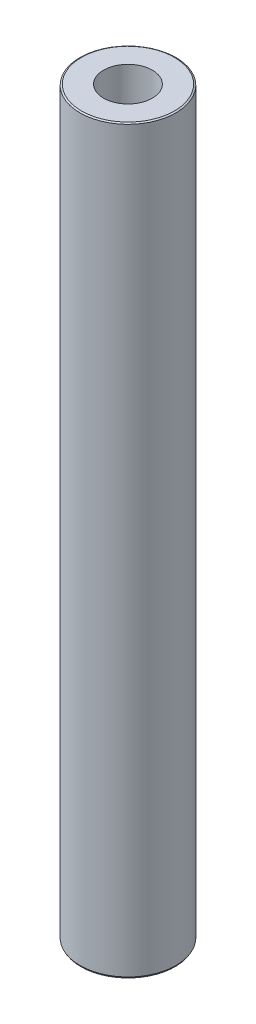
ISO-10303-21;
HEADER;
FILE_DESCRIPTION(('STEP AP214'),'2;1');
FILE_NAME('part.step','',(''),(''),'','','');
FILE_SCHEMA(('AUTOMOTIVE_DESIGN { 1 0 10303 214 1 1 1 1 }'));
ENDSEC;
DATA;
#1=APPLICATION_CONTEXT('core data for automotive mechanical design processes');
#2=APPLICATION_PROTOCOL_DEFINITION('international standard','automotive_design',2000,#1);
#3=PRODUCT_CONTEXT('',#1,'mechanical');
#4=PRODUCT('Part','Part','',(#3));
#5=PRODUCT_RELATED_PRODUCT_CATEGORY('part','',(#4));
#6=PRODUCT_DEFINITION_FORMATION('','',#4);
#7=PRODUCT_DEFINITION_CONTEXT('part definition',#1,'design');
#8=PRODUCT_DEFINITION('design','',#6,#7);
#9=PRODUCT_DEFINITION_SHAPE('','',#8);
#10=(LENGTH_UNIT() NAMED_UNIT(*) SI_UNIT(.MILLI.,.METRE.));
#11=(NAMED_UNIT(*) PLANE_ANGLE_UNIT() SI_UNIT($,.RADIAN.));
#12=(NAMED_UNIT(*) SI_UNIT($,.STERADIAN.) SOLID_ANGLE_UNIT());
#13=UNCERTAINTY_MEASURE_WITH_UNIT(LENGTH_MEASURE(1.E-05),#10,'distance_accuracy_value','');
#14=(GEOMETRIC_REPRESENTATION_CONTEXT(3) GLOBAL_UNCERTAINTY_ASSIGNED_CONTEXT((#13)) GLOBAL_UNIT_ASSIGNED_CONTEXT((#10,
#11,#12)) REPRESENTATION_CONTEXT('',''));
#15=CARTESIAN_POINT('',(0.,0.,0.));
#16=DIRECTION('',(0.,0.,1.));
#17=DIRECTION('',(1.,0.,0.));
#18=AXIS2_PLACEMENT_3D('',#15,#16,#17);
#19=CARTESIAN_POINT('',(0.,540.408234827702,0.));
#20=DIRECTION('',(0.,-1.,0.));
#21=DIRECTION('',(0.,0.,-1.));
#22=AXIS2_PLACEMENT_3D('',#19,#20,#21);
#23=CYLINDRICAL_SURFACE('',#22,35.);
#24=CARTESIAN_POINT('',(0.,539.767455256213,0.));
#25=DIRECTION('',(0.,1.,0.));
#26=DIRECTION('',(0.,0.,1.));
#27=AXIS2_PLACEMENT_3D('',#24,#25,#26);
#28=CIRCLE('',#27,35.);
#29=CARTESIAN_POINT('',(0.,539.767455256213,35.));
#30=VERTEX_POINT('',#29);
#31=EDGE_CURVE('E50',#30,#30,#28,.F.);
#32=ORIENTED_EDGE('',*,*,#31,.T.);
#33=EDGE_LOOP('',(#32));
#34=FACE_BOUND('',#33,.T.);
#35=CARTESIAN_POINT('',(0.,1.10986277427283,0.));
#36=DIRECTION('',(0.,1.,0.));
#37=DIRECTION('',(0.,0.,1.));
#38=AXIS2_PLACEMENT_3D('',#35,#36,#37);
#39=CIRCLE('',#38,35.);
#40=CARTESIAN_POINT('',(0.,1.10986277427283,35.));
#41=VERTEX_POINT('',#40);
#42=EDGE_CURVE('E51',#41,#41,#39,.T.);
#43=ORIENTED_EDGE('',*,*,#42,.T.);
#44=EDGE_LOOP('',(#43));
#45=FACE_BOUND('',#44,.T.);
#46=ADVANCED_FACE('F39',(#34,#45),#23,.T.);
#47=CARTESIAN_POINT('',(0.,540.408234827702,0.));
#48=DIRECTION('',(0.,1.,0.));
#49=DIRECTION('',(0.,0.,1.));
#50=AXIS2_PLACEMENT_3D('',#47,#48,#49);
#51=PLANE('',#50);
#52=CARTESIAN_POINT('',(0.,540.408234827702,0.));
#53=DIRECTION('',(0.,1.,0.));
#54=DIRECTION('',(0.,0.,1.));
#55=AXIS2_PLACEMENT_3D('',#52,#53,#54);
#56=CIRCLE('',#55,33.8901372257275);
#57=CARTESIAN_POINT('',(0.,540.408234827702,33.8901372257275));
#58=VERTEX_POINT('',#57);
#59=EDGE_CURVE('E54',#58,#58,#56,.T.);
#60=ORIENTED_EDGE('',*,*,#59,.T.);
#61=EDGE_LOOP('',(#60));
#62=FACE_BOUND('',#61,.T.);
#63=CARTESIAN_POINT('',(0.,540.408234827702,0.));
#64=DIRECTION('',(0.,1.,0.));
#65=DIRECTION('',(0.,0.,1.));
#66=AXIS2_PLACEMENT_3D('',#63,#64,#65);
#67=CIRCLE('',#66,17.7537579420292);
#68=CARTESIAN_POINT('',(0.,540.408234827702,17.7537579420292));
#69=VERTEX_POINT('',#68);
#70=EDGE_CURVE('E58',#69,#69,#67,.T.);
#71=ORIENTED_EDGE('',*,*,#70,.F.);
#72=EDGE_LOOP('',(#71));
#73=FACE_BOUND('',#72,.T.);
#74=ADVANCED_FACE('F69',(#62,#73),#51,.T.);
#75=CARTESIAN_POINT('',(0.,0.,0.));
#76=DIRECTION('',(0.,1.,0.));
#77=DIRECTION('',(0.,0.,1.));
#78=AXIS2_PLACEMENT_3D('',#75,#76,#77);
#79=PLANE('',#78);
#80=CARTESIAN_POINT('',(0.,0.,0.));
#81=DIRECTION('',(0.,1.,0.));
#82=DIRECTION('',(0.,0.,1.));
#83=AXIS2_PLACEMENT_3D('',#80,#81,#82);
#84=CIRCLE('',#83,34.35922042851);
#85=CARTESIAN_POINT('',(0.,0.,34.35922042851));
#86=VERTEX_POINT('',#85);
#87=EDGE_CURVE('E10',#86,#86,#84,.F.);
#88=ORIENTED_EDGE('',*,*,#87,.T.);
#89=EDGE_LOOP('',(#88));
#90=FACE_BOUND('',#89,.T.);
#91=CARTESIAN_POINT('',(0.,0.,0.));
#92=DIRECTION('',(0.,1.,0.));
#93=DIRECTION('',(0.,0.,1.));
#94=AXIS2_PLACEMENT_3D('',#91,#92,#93);
#95=CIRCLE('',#94,17.7537579420292);
#96=CARTESIAN_POINT('',(0.,0.,17.7537579420292));
#97=VERTEX_POINT('',#96);
#98=EDGE_CURVE('E63',#97,#97,#95,.T.);
#99=ORIENTED_EDGE('',*,*,#98,.T.);
#100=EDGE_LOOP('',(#99));
#101=FACE_BOUND('',#100,.T.);
#102=ADVANCED_FACE('F75',(#90,#101),#79,.F.);
#103=CARTESIAN_POINT('',(0.,540.408234827702,0.));
#104=DIRECTION('',(0.,-1.,0.));
#105=DIRECTION('',(0.,0.,-1.));
#106=AXIS2_PLACEMENT_3D('',#103,#104,#105);
#107=CYLINDRICAL_SURFACE('',#106,17.7537579420292);
#108=ORIENTED_EDGE('',*,*,#70,.T.);
#109=EDGE_LOOP('',(#108));
#110=FACE_BOUND('',#109,.T.);
#111=ORIENTED_EDGE('',*,*,#98,.F.);
#112=EDGE_LOOP('',(#111));
#113=FACE_BOUND('',#112,.T.);
#114=ADVANCED_FACE('F70',(#110,#113),#107,.F.);
#115=CARTESIAN_POINT('',(0.,540.408234827702,0.));
#116=DIRECTION('',(0.,-1.,0.));
#117=DIRECTION('',(0.,0.,-1.));
#118=AXIS2_PLACEMENT_3D('',#115,#116,#117);
#119=CONICAL_SURFACE('',#118,33.8901372257275,1.04719755119658);
#120=ORIENTED_EDGE('',*,*,#31,.F.);
#121=EDGE_LOOP('',(#120));
#122=FACE_BOUND('',#121,.T.);
#123=ORIENTED_EDGE('',*,*,#59,.F.);
#124=EDGE_LOOP('',(#123));
#125=FACE_BOUND('',#124,.T.);
#126=ADVANCED_FACE('F81',(#122,#125),#119,.T.);
#127=CARTESIAN_POINT('',(0.,1.10986277427283,0.));
#128=DIRECTION('',(0.,1.,0.));
#129=DIRECTION('',(0.,0.,1.));
#130=AXIS2_PLACEMENT_3D('',#127,#128,#129);
#131=CONICAL_SURFACE('',#130,35.,0.523598775598311);
#132=CARTESIAN_POINT('',(0.,0.,34.35922042851));
#133=CARTESIAN_POINT('',(0.,0.0115610705653418,34.3658952157131));
#134=CARTESIAN_POINT('',(0.,0.0231221411306838,34.3725700029161));
#135=CARTESIAN_POINT('',(0.,0.0462442822613677,34.3859195773221));
#136=CARTESIAN_POINT('',(0.,0.0578053528267096,34.3925943645251));
#137=CARTESIAN_POINT('',(0.,0.0809274939573937,34.4059439389312));
#138=CARTESIAN_POINT('',(0.,0.0924885645227358,34.4126187261342));
#139=CARTESIAN_POINT('',(0.,0.115610705653419,34.4259683005402));
#140=CARTESIAN_POINT('',(0.,0.127171776218761,34.4326430877433));
#141=CARTESIAN_POINT('',(0.,0.150293917349445,34.4459926621493));
#142=CARTESIAN_POINT('',(0.,0.161854987914788,34.4526674493523));
#143=CARTESIAN_POINT('',(0.,0.184977129045472,34.4660170237584));
#144=CARTESIAN_POINT('',(0.,0.196538199610813,34.4726918109614));
#145=CARTESIAN_POINT('',(0.,0.219660340741497,34.4860413853674));
#146=CARTESIAN_POINT('',(0.,0.231221411306839,34.4927161725704));
#147=CARTESIAN_POINT('',(0.,0.254343552437523,34.5060657469765));
#148=CARTESIAN_POINT('',(0.,0.265904623002865,34.5127405341795));
#149=CARTESIAN_POINT('',(0.,0.289026764133549,34.5260901085855));
#150=CARTESIAN_POINT('',(0.,0.300587834698891,34.5327648957886));
#151=CARTESIAN_POINT('',(0.,0.323709975829575,34.5461144701946));
#152=CARTESIAN_POINT('',(0.,0.335271046394917,34.5527892573976));
#153=CARTESIAN_POINT('',(0.,0.358393187525601,34.5661388318037));
#154=CARTESIAN_POINT('',(0.,0.369954258090943,34.5728136190067));
#155=CARTESIAN_POINT('',(0.,0.393076399221627,34.5861631934127));
#156=CARTESIAN_POINT('',(0.,0.404637469786969,34.5928379806157));
#157=CARTESIAN_POINT('',(0.,0.427759610917653,34.6061875550218));
#158=CARTESIAN_POINT('',(0.,0.439320681482995,34.6128623422248));
#159=CARTESIAN_POINT('',(0.,0.462442822613679,34.6262119166309));
#160=CARTESIAN_POINT('',(0.,0.474003893179021,34.6328867038339));
#161=CARTESIAN_POINT('',(0.,0.497126034309704,34.6462362782399));
#162=CARTESIAN_POINT('',(0.,0.508687104875046,34.6529110654429));
#163=CARTESIAN_POINT('',(0.,0.53180924600573,34.666260639849));
#164=CARTESIAN_POINT('',(0.,0.543370316571073,34.672935427052));
#165=CARTESIAN_POINT('',(0.,0.566492457701757,34.686285001458));
#166=CARTESIAN_POINT('',(0.,0.578053528267099,34.6929597886611));
#167=CARTESIAN_POINT('',(0.,0.601175669397782,34.7063093630671));
#168=CARTESIAN_POINT('',(0.,0.612736739963124,34.7129841502701));
#169=CARTESIAN_POINT('',(0.,0.635858881093808,34.7263337246762));
#170=CARTESIAN_POINT('',(0.,0.64741995165915,34.7330085118792));
#171=CARTESIAN_POINT('',(0.,0.670542092789834,34.7463580862852));
#172=CARTESIAN_POINT('',(0.,0.682103163355176,34.7530328734882));
#173=CARTESIAN_POINT('',(0.,0.70522530448586,34.7663824478943));
#174=CARTESIAN_POINT('',(0.,0.716786375051202,34.7730572350973));
#175=CARTESIAN_POINT('',(0.,0.739908516181886,34.7864068095034));
#176=CARTESIAN_POINT('',(0.,0.751469586747228,34.7930815967064));
#177=CARTESIAN_POINT('',(0.,0.774591727877912,34.8064311711124));
#178=CARTESIAN_POINT('',(0.,0.786152798443254,34.8131059583154));
#179=CARTESIAN_POINT('',(0.,0.809274939573938,34.8264555327215));
#180=CARTESIAN_POINT('',(0.,0.82083601013928,34.8331303199245));
#181=CARTESIAN_POINT('',(0.,0.843958151269964,34.8464798943305));
#182=CARTESIAN_POINT('',(0.,0.855519221835306,34.8531546815336));
#183=CARTESIAN_POINT('',(0.,0.87864136296599,34.8665042559396));
#184=CARTESIAN_POINT('',(0.,0.890202433531331,34.8731790431426));
#185=CARTESIAN_POINT('',(0.,0.913324574662015,34.8865286175487));
#186=CARTESIAN_POINT('',(0.,0.924885645227358,34.8932034047517));
#187=CARTESIAN_POINT('',(0.,0.948007786358042,34.9065529791577));
#188=CARTESIAN_POINT('',(0.,0.959568856923384,34.9132277663607));
#189=CARTESIAN_POINT('',(0.,0.982690998054067,34.9265773407668));
#190=CARTESIAN_POINT('',(0.,0.99425206861941,34.9332521279698));
#191=CARTESIAN_POINT('',(0.,1.01737420975009,34.9466017023758));
#192=CARTESIAN_POINT('',(0.,1.02893528031544,34.9532764895789));
#193=CARTESIAN_POINT('',(0.,1.05205742144612,34.9666260639849));
#194=CARTESIAN_POINT('',(0.,1.06361849201146,34.9733008511879));
#195=CARTESIAN_POINT('',(0.,1.08674063314215,34.986650425594));
#196=CARTESIAN_POINT('',(0.,1.09830170370749,34.993325212797));
#197=CARTESIAN_POINT('',(0.,1.10986277427283,35.));
#198=B_SPLINE_CURVE_WITH_KNOTS('',3,(#132,#133,#134,#135,#136,#137,#138,#139,#140,#141,#142,
#143,#144,#145,#146,#147,#148,#149,#150,#151,#152,#153,#154,#155,#156,#157,#158,#159,#160,#161,
#162,#163,#164,#165,#166,#167,#168,#169,#170,#171,#172,#173,#174,#175,#176,#177,#178,#179,#180,
#181,#182,#183,#184,#185,#186,#187,#188,#189,#190,#191,#192,#193,#194,#195,#196,#197),
.UNSPECIFIED.,.F.,.F.,(4,2,2,2,2,2,2,2,2,2,2,2,2,2,2,2,2,2,2,2,2,2,2,2,2,2,2,2,2,2,2,2,4),(0.,
0.0400487232181233,0.0800974464362466,0.12014616965437,0.160194892872493,0.200243616090613,
0.240292339308736,0.28034106252686,0.320389785744983,0.360438508963106,0.400487232181229,
0.440535955399353,0.480584678617476,0.520633401835599,0.560682125053723,0.600730848271846,
0.640779571489966,0.680828294708089,0.720877017926213,0.760925741144336,0.800974464362459,
0.841023187580582,0.881071910798706,0.921120634016829,0.961169357234952,1.00121808045308,
1.0412668036712,1.08131552688932,1.12136425010744,1.16141297332557,1.20146169654369,
1.24151041976181,1.28155914297994),.UNSPECIFIED.);
#199=EDGE_CURVE('BSEAM45',#86,#41,#198,.T.);
#200=ORIENTED_EDGE('',*,*,#87,.F.);
#201=ORIENTED_EDGE('',*,*,#42,.F.);
#202=ORIENTED_EDGE('',*,*,#199,.T.);
#203=ORIENTED_EDGE('',*,*,#199,.F.);
#204=EDGE_LOOP('',(#200,#202,#201,#203));
#205=FACE_BOUND('',#204,.T.);
#206=ADVANCED_FACE('F45',(#205),#131,.T.);
#207=CLOSED_SHELL('',(#46,#74,#102,#114,#126,#206));
#208=MANIFOLD_SOLID_BREP('B2',#207);
#209=ADVANCED_BREP_SHAPE_REPRESENTATION('',(#18,#208),#14);
#210=SHAPE_DEFINITION_REPRESENTATION(#9,#209);
ENDSEC;
END-ISO-10303-21;
